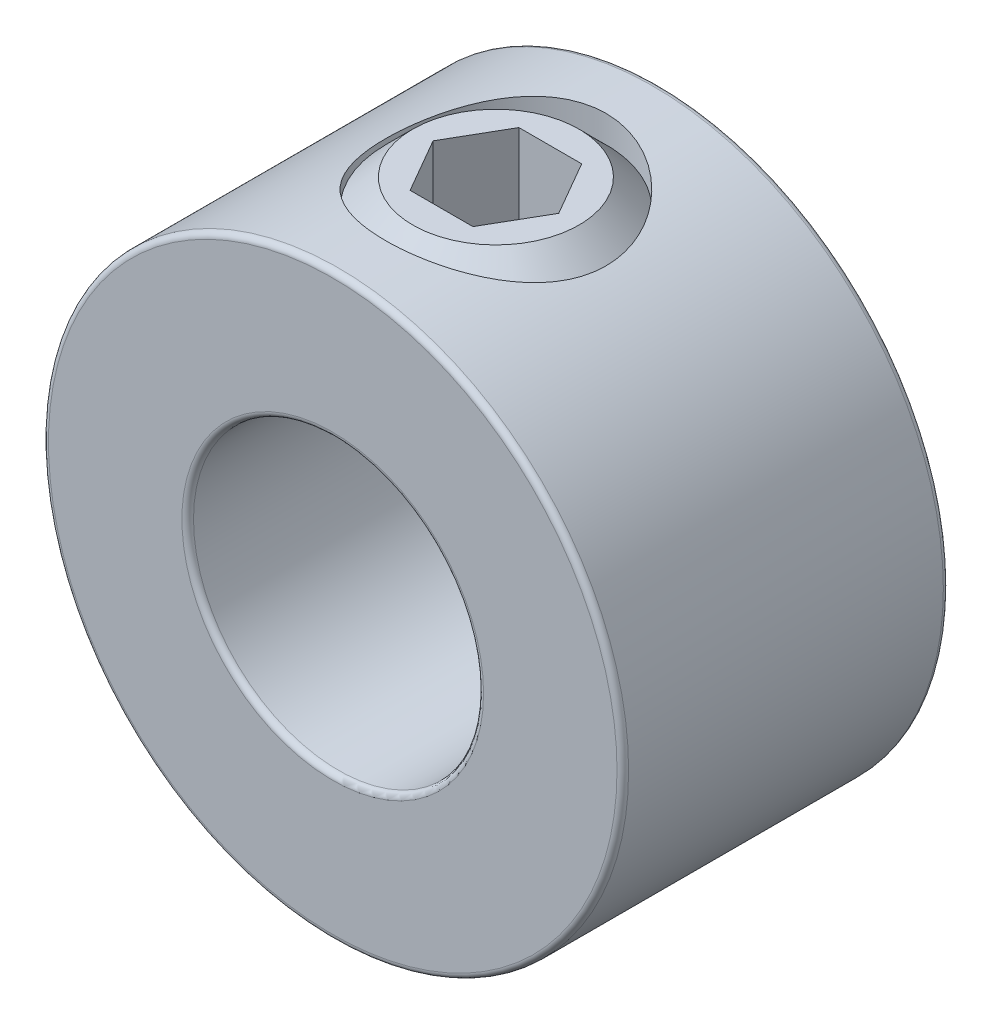
ISO-10303-21;
HEADER;
FILE_DESCRIPTION(('STEP AP214'),'2;1');
FILE_NAME('part.step','',(''),(''),'','','');
FILE_SCHEMA(('AUTOMOTIVE_DESIGN { 1 0 10303 214 1 1 1 1 }'));
ENDSEC;
DATA;
#1=APPLICATION_CONTEXT('core data for automotive mechanical design processes');
#2=APPLICATION_PROTOCOL_DEFINITION('international standard','automotive_design',2000,#1);
#3=PRODUCT_CONTEXT('',#1,'mechanical');
#4=PRODUCT('Part','Part','',(#3));
#5=PRODUCT_RELATED_PRODUCT_CATEGORY('part','',(#4));
#6=PRODUCT_DEFINITION_FORMATION('','',#4);
#7=PRODUCT_DEFINITION_CONTEXT('part definition',#1,'design');
#8=PRODUCT_DEFINITION('design','',#6,#7);
#9=PRODUCT_DEFINITION_SHAPE('','',#8);
#10=(LENGTH_UNIT() NAMED_UNIT(*) SI_UNIT(.MILLI.,.METRE.));
#11=(NAMED_UNIT(*) PLANE_ANGLE_UNIT() SI_UNIT($,.RADIAN.));
#12=(NAMED_UNIT(*) SI_UNIT($,.STERADIAN.) SOLID_ANGLE_UNIT());
#13=UNCERTAINTY_MEASURE_WITH_UNIT(LENGTH_MEASURE(1.E-05),#10,'distance_accuracy_value','');
#14=(GEOMETRIC_REPRESENTATION_CONTEXT(3) GLOBAL_UNCERTAINTY_ASSIGNED_CONTEXT((#13)) GLOBAL_UNIT_ASSIGNED_CONTEXT((#10,
#11,#12)) REPRESENTATION_CONTEXT('',''));
#15=CARTESIAN_POINT('',(0.,0.,0.));
#16=DIRECTION('',(0.,0.,1.));
#17=DIRECTION('',(1.,0.,0.));
#18=AXIS2_PLACEMENT_3D('',#15,#16,#17);
#19=CARTESIAN_POINT('',(0.,6.35,0.));
#20=DIRECTION('',(0.,1.,0.));
#21=DIRECTION('',(-1.,0.,0.));
#22=AXIS2_PLACEMENT_3D('',#19,#20,#21);
#23=PLANE('',#22);
#24=CARTESIAN_POINT('',(0.,6.35,0.));
#25=DIRECTION('',(0.,1.,0.));
#26=DIRECTION('',(-1.,0.,0.));
#27=AXIS2_PLACEMENT_3D('',#24,#25,#26);
#28=CIRCLE('',#27,1.81975161629017);
#29=CARTESIAN_POINT('',(-1.81975161629017,6.35,0.));
#30=VERTEX_POINT('',#29);
#31=EDGE_CURVE('E12',#30,#30,#28,.T.);
#32=ORIENTED_EDGE('',*,*,#31,.T.);
#33=EDGE_LOOP('',(#32));
#34=FACE_BOUND('',#33,.T.);
#35=DIRECTION('',(1.,0.,0.));
#36=VECTOR('',#35,1.);
#37=CARTESIAN_POINT('',(-0.687407664253899,6.34999999999999,-1.190625));
#38=LINE('',#37,#36);
#39=CARTESIAN_POINT('',(-0.687407664253899,6.34999999999999,-1.190625));
#40=VERTEX_POINT('',#39);
#41=CARTESIAN_POINT('',(0.687407664253899,6.35,-1.190625));
#42=VERTEX_POINT('',#41);
#43=EDGE_CURVE('E126',#40,#42,#38,.T.);
#44=ORIENTED_EDGE('',*,*,#43,.T.);
#45=DIRECTION('',(0.5,0.,0.866025403784439));
#46=VECTOR('',#45,1.);
#47=CARTESIAN_POINT('',(0.687407664253899,6.34999999999999,-1.190625));
#48=LINE('',#47,#46);
#49=CARTESIAN_POINT('',(1.3748153285078,6.34999999999999,0.));
#50=VERTEX_POINT('',#49);
#51=EDGE_CURVE('E70',#42,#50,#48,.T.);
#52=ORIENTED_EDGE('',*,*,#51,.T.);
#53=DIRECTION('',(-0.5,0.,0.866025403784439));
#54=VECTOR('',#53,1.);
#55=CARTESIAN_POINT('',(1.3748153285078,6.34999999999999,0.));
#56=LINE('',#55,#54);
#57=CARTESIAN_POINT('',(0.687407664253899,6.34999999999999,1.190625));
#58=VERTEX_POINT('',#57);
#59=EDGE_CURVE('E130',#50,#58,#56,.T.);
#60=ORIENTED_EDGE('',*,*,#59,.T.);
#61=DIRECTION('',(-1.,0.,0.));
#62=VECTOR('',#61,1.);
#63=CARTESIAN_POINT('',(0.687407664253899,6.34999999999999,1.190625));
#64=LINE('',#63,#62);
#65=CARTESIAN_POINT('',(-0.687407664253899,6.34999999999999,1.190625));
#66=VERTEX_POINT('',#65);
#67=EDGE_CURVE('E209',#58,#66,#64,.T.);
#68=ORIENTED_EDGE('',*,*,#67,.T.);
#69=DIRECTION('',(-0.5,0.,-0.866025403784439));
#70=VECTOR('',#69,1.);
#71=CARTESIAN_POINT('',(-0.687407664253899,6.34999999999999,1.190625));
#72=LINE('',#71,#70);
#73=CARTESIAN_POINT('',(-1.3748153285078,6.34999999999999,0.));
#74=VERTEX_POINT('',#73);
#75=EDGE_CURVE('E189',#66,#74,#72,.T.);
#76=ORIENTED_EDGE('',*,*,#75,.T.);
#77=DIRECTION('',(0.5,0.,-0.866025403784439));
#78=VECTOR('',#77,1.);
#79=CARTESIAN_POINT('',(-1.3748153285078,6.34999999999999,0.));
#80=LINE('',#79,#78);
#81=EDGE_CURVE('E182',#74,#40,#80,.T.);
#82=ORIENTED_EDGE('',*,*,#81,.T.);
#83=EDGE_LOOP('',(#44,#52,#60,#68,#76,#82));
#84=FACE_BOUND('',#83,.T.);
#85=ADVANCED_FACE('F55',(#34,#84),#23,.T.);
#86=CARTESIAN_POINT('',(0.,6.35,0.));
#87=DIRECTION('',(0.,-1.,0.));
#88=DIRECTION('',(1.,0.,0.));
#89=AXIS2_PLACEMENT_3D('',#86,#87,#88);
#90=CONICAL_SURFACE('',#89,1.81975161629017,0.785398163397449);
#91=CARTESIAN_POINT('',(0.,5.75675161629017,0.));
#92=DIRECTION('',(0.,1.,0.));
#93=DIRECTION('',(-1.,0.,0.));
#94=AXIS2_PLACEMENT_3D('',#91,#92,#93);
#95=CIRCLE('',#94,2.413);
#96=CARTESIAN_POINT('',(-2.413,5.75675161629017,0.));
#97=VERTEX_POINT('',#96);
#98=EDGE_CURVE('E63',#97,#97,#95,.T.);
#99=ORIENTED_EDGE('',*,*,#98,.T.);
#100=EDGE_LOOP('',(#99));
#101=FACE_BOUND('',#100,.T.);
#102=ORIENTED_EDGE('',*,*,#31,.F.);
#103=EDGE_LOOP('',(#102));
#104=FACE_BOUND('',#103,.T.);
#105=ADVANCED_FACE('F156',(#101,#104),#90,.T.);
#106=CARTESIAN_POINT('',(0.,3.175,0.));
#107=DIRECTION('',(0.,1.,0.));
#108=DIRECTION('',(-1.,0.,0.));
#109=AXIS2_PLACEMENT_3D('',#106,#107,#108);
#110=CYLINDRICAL_SURFACE('',#109,2.413);
#111=CARTESIAN_POINT('',(0.,3.76824838370983,0.));
#112=DIRECTION('',(0.,1.,0.));
#113=DIRECTION('',(-1.,0.,0.));
#114=AXIS2_PLACEMENT_3D('',#111,#112,#113);
#115=CIRCLE('',#114,2.413);
#116=CARTESIAN_POINT('',(-2.413,3.76824838370983,0.));
#117=VERTEX_POINT('',#116);
#118=EDGE_CURVE('E148',#117,#117,#115,.T.);
#119=ORIENTED_EDGE('',*,*,#118,.T.);
#120=EDGE_LOOP('',(#119));
#121=FACE_BOUND('',#120,.T.);
#122=ORIENTED_EDGE('',*,*,#98,.F.);
#123=EDGE_LOOP('',(#122));
#124=FACE_BOUND('',#123,.T.);
#125=ADVANCED_FACE('F159',(#121,#124),#110,.T.);
#126=CARTESIAN_POINT('',(0.,3.76824838370983,0.));
#127=DIRECTION('',(0.,1.,0.));
#128=DIRECTION('',(-1.,0.,0.));
#129=AXIS2_PLACEMENT_3D('',#126,#127,#128);
#130=CONICAL_SURFACE('',#129,2.413,0.785398163397448);
#131=CARTESIAN_POINT('',(0.,3.175,0.));
#132=DIRECTION('',(0.,1.,0.));
#133=DIRECTION('',(-1.,0.,0.));
#134=AXIS2_PLACEMENT_3D('',#131,#132,#133);
#135=CIRCLE('',#134,1.81975161629017);
#136=CARTESIAN_POINT('',(-1.81975161629017,3.175,0.));
#137=VERTEX_POINT('',#136);
#138=EDGE_CURVE('E139',#137,#137,#135,.T.);
#139=ORIENTED_EDGE('',*,*,#138,.T.);
#140=EDGE_LOOP('',(#139));
#141=FACE_BOUND('',#140,.T.);
#142=ORIENTED_EDGE('',*,*,#118,.F.);
#143=EDGE_LOOP('',(#142));
#144=FACE_BOUND('',#143,.T.);
#145=ADVANCED_FACE('F161',(#141,#144),#130,.T.);
#146=CARTESIAN_POINT('',(-1.81975161629017,3.175,0.));
#147=DIRECTION('',(0.,-1.,0.));
#148=DIRECTION('',(1.,0.,0.));
#149=AXIS2_PLACEMENT_3D('',#146,#147,#148);
#150=PLANE('',#149);
#151=CARTESIAN_POINT('',(0.,3.175,0.));
#152=DIRECTION('',(0.,1.,0.));
#153=DIRECTION('',(-1.,0.,0.));
#154=AXIS2_PLACEMENT_3D('',#151,#152,#153);
#155=CIRCLE('',#154,0.711898060451796);
#156=CARTESIAN_POINT('',(-0.711898060451796,3.175,0.));
#157=VERTEX_POINT('',#156);
#158=EDGE_CURVE('E132',#157,#157,#155,.T.);
#159=ORIENTED_EDGE('',*,*,#158,.T.);
#160=EDGE_LOOP('',(#159));
#161=FACE_BOUND('',#160,.T.);
#162=ORIENTED_EDGE('',*,*,#138,.F.);
#163=EDGE_LOOP('',(#162));
#164=FACE_BOUND('',#163,.T.);
#165=ADVANCED_FACE('F168',(#161,#164),#150,.T.);
#166=CARTESIAN_POINT('',(0.,3.175,0.));
#167=DIRECTION('',(0.,-1.,0.));
#168=DIRECTION('',(1.,0.,0.));
#169=AXIS2_PLACEMENT_3D('',#166,#167,#168);
#170=CONICAL_SURFACE('',#169,0.711898060451796,0.785398163397448);
#171=CARTESIAN_POINT('',(0.,3.8868980604518,0.));
#172=VERTEX_POINT('',#171);
#173=VERTEX_LOOP('',#172);
#174=FACE_BOUND('',#173,.T.);
#175=ORIENTED_EDGE('',*,*,#158,.F.);
#176=EDGE_LOOP('',(#175));
#177=FACE_BOUND('',#176,.T.);
#178=ADVANCED_FACE('F261',(#174,#177),#170,.F.);
#179=CARTESIAN_POINT('',(0.687407664253899,3.96874999999999,-1.190625));
#180=DIRECTION('',(-0.866025403784439,0.,0.5));
#181=DIRECTION('',(0.5,0.,0.866025403784438));
#182=AXIS2_PLACEMENT_3D('',#179,#180,#181);
#183=PLANE('',#182);
#184=ORIENTED_EDGE('',*,*,#51,.F.);
#185=DIRECTION('',(0.,1.,0.));
#186=VECTOR('',#185,1.);
#187=CARTESIAN_POINT('',(0.687407664253899,3.96874999999999,-1.190625));
#188=LINE('',#187,#186);
#189=CARTESIAN_POINT('',(0.687407664253899,3.96874999999999,-1.190625));
#190=VERTEX_POINT('',#189);
#191=EDGE_CURVE('E124',#190,#42,#188,.T.);
#192=ORIENTED_EDGE('',*,*,#191,.F.);
#193=DIRECTION('',(0.5,0.,0.866025403784439));
#194=VECTOR('',#193,1.);
#195=CARTESIAN_POINT('',(0.687407664253899,3.96874999999999,-1.190625));
#196=LINE('',#195,#194);
#197=CARTESIAN_POINT('',(1.3748153285078,3.96874999999999,0.));
#198=VERTEX_POINT('',#197);
#199=EDGE_CURVE('E114',#190,#198,#196,.T.);
#200=ORIENTED_EDGE('',*,*,#199,.T.);
#201=DIRECTION('',(0.,1.,0.));
#202=VECTOR('',#201,1.);
#203=CARTESIAN_POINT('',(1.3748153285078,3.96874999999999,0.));
#204=LINE('',#203,#202);
#205=EDGE_CURVE('E123',#198,#50,#204,.T.);
#206=ORIENTED_EDGE('',*,*,#205,.T.);
#207=EDGE_LOOP('',(#184,#192,#200,#206));
#208=FACE_BOUND('',#207,.T.);
#209=ADVANCED_FACE('F122',(#208),#183,.T.);
#210=CARTESIAN_POINT('',(1.3748153285078,3.96874999999999,0.));
#211=DIRECTION('',(-0.866025403784439,0.,-0.5));
#212=DIRECTION('',(-0.5,0.,0.866025403784439));
#213=AXIS2_PLACEMENT_3D('',#210,#211,#212);
#214=PLANE('',#213);
#215=ORIENTED_EDGE('',*,*,#59,.F.);
#216=ORIENTED_EDGE('',*,*,#205,.F.);
#217=DIRECTION('',(-0.5,0.,0.866025403784439));
#218=VECTOR('',#217,1.);
#219=CARTESIAN_POINT('',(1.3748153285078,3.96874999999999,0.));
#220=LINE('',#219,#218);
#221=CARTESIAN_POINT('',(0.687407664253899,3.96874999999999,1.190625));
#222=VERTEX_POINT('',#221);
#223=EDGE_CURVE('E110',#198,#222,#220,.T.);
#224=ORIENTED_EDGE('',*,*,#223,.T.);
#225=DIRECTION('',(0.,1.,0.));
#226=VECTOR('',#225,1.);
#227=CARTESIAN_POINT('',(0.687407664253899,3.96874999999999,1.190625));
#228=LINE('',#227,#226);
#229=EDGE_CURVE('E133',#222,#58,#228,.T.);
#230=ORIENTED_EDGE('',*,*,#229,.T.);
#231=EDGE_LOOP('',(#215,#216,#224,#230));
#232=FACE_BOUND('',#231,.T.);
#233=ADVANCED_FACE('F128',(#232),#214,.T.);
#234=CARTESIAN_POINT('',(0.687407664253899,3.96874999999999,1.190625));
#235=DIRECTION('',(0.,0.,-1.));
#236=DIRECTION('',(-1.,0.,0.));
#237=AXIS2_PLACEMENT_3D('',#234,#235,#236);
#238=PLANE('',#237);
#239=ORIENTED_EDGE('',*,*,#67,.F.);
#240=ORIENTED_EDGE('',*,*,#229,.F.);
#241=DIRECTION('',(-1.,0.,0.));
#242=VECTOR('',#241,1.);
#243=CARTESIAN_POINT('',(0.687407664253899,3.96874999999999,1.190625));
#244=LINE('',#243,#242);
#245=CARTESIAN_POINT('',(-0.687407664253899,3.96874999999999,1.190625));
#246=VERTEX_POINT('',#245);
#247=EDGE_CURVE('E116',#222,#246,#244,.T.);
#248=ORIENTED_EDGE('',*,*,#247,.T.);
#249=DIRECTION('',(0.,1.,0.));
#250=VECTOR('',#249,1.);
#251=CARTESIAN_POINT('',(-0.687407664253899,3.96874999999999,1.190625));
#252=LINE('',#251,#250);
#253=EDGE_CURVE('E141',#246,#66,#252,.T.);
#254=ORIENTED_EDGE('',*,*,#253,.T.);
#255=EDGE_LOOP('',(#239,#240,#248,#254));
#256=FACE_BOUND('',#255,.T.);
#257=ADVANCED_FACE('F207',(#256),#238,.T.);
#258=CARTESIAN_POINT('',(-0.687407664253899,3.96874999999999,1.190625));
#259=DIRECTION('',(0.866025403784439,0.,-0.5));
#260=DIRECTION('',(-0.5,0.,-0.866025403784438));
#261=AXIS2_PLACEMENT_3D('',#258,#259,#260);
#262=PLANE('',#261);
#263=ORIENTED_EDGE('',*,*,#75,.F.);
#264=ORIENTED_EDGE('',*,*,#253,.F.);
#265=DIRECTION('',(-0.5,0.,-0.866025403784439));
#266=VECTOR('',#265,1.);
#267=CARTESIAN_POINT('',(-0.687407664253899,3.96874999999999,1.190625));
#268=LINE('',#267,#266);
#269=CARTESIAN_POINT('',(-1.3748153285078,3.96874999999999,0.));
#270=VERTEX_POINT('',#269);
#271=EDGE_CURVE('E227',#246,#270,#268,.T.);
#272=ORIENTED_EDGE('',*,*,#271,.T.);
#273=DIRECTION('',(0.,1.,0.));
#274=VECTOR('',#273,1.);
#275=CARTESIAN_POINT('',(-1.3748153285078,3.96874999999999,0.));
#276=LINE('',#275,#274);
#277=EDGE_CURVE('E199',#270,#74,#276,.T.);
#278=ORIENTED_EDGE('',*,*,#277,.T.);
#279=EDGE_LOOP('',(#263,#264,#272,#278));
#280=FACE_BOUND('',#279,.T.);
#281=ADVANCED_FACE('F211',(#280),#262,.T.);
#282=CARTESIAN_POINT('',(-1.3748153285078,3.96874999999999,0.));
#283=DIRECTION('',(0.866025403784439,0.,0.5));
#284=DIRECTION('',(0.5,0.,-0.866025403784439));
#285=AXIS2_PLACEMENT_3D('',#282,#283,#284);
#286=PLANE('',#285);
#287=ORIENTED_EDGE('',*,*,#81,.F.);
#288=ORIENTED_EDGE('',*,*,#277,.F.);
#289=DIRECTION('',(0.5,0.,-0.866025403784439));
#290=VECTOR('',#289,1.);
#291=CARTESIAN_POINT('',(-1.3748153285078,3.96874999999999,0.));
#292=LINE('',#291,#290);
#293=CARTESIAN_POINT('',(-0.687407664253899,3.96874999999999,-1.190625));
#294=VERTEX_POINT('',#293);
#295=EDGE_CURVE('E224',#270,#294,#292,.T.);
#296=ORIENTED_EDGE('',*,*,#295,.T.);
#297=DIRECTION('',(0.,1.,0.));
#298=VECTOR('',#297,1.);
#299=CARTESIAN_POINT('',(-0.687407664253899,3.96874999999999,-1.190625));
#300=LINE('',#299,#298);
#301=EDGE_CURVE('E195',#294,#40,#300,.T.);
#302=ORIENTED_EDGE('',*,*,#301,.T.);
#303=EDGE_LOOP('',(#287,#288,#296,#302));
#304=FACE_BOUND('',#303,.T.);
#305=ADVANCED_FACE('F242',(#304),#286,.T.);
#306=CARTESIAN_POINT('',(-0.687407664253899,3.96874999999999,-1.190625));
#307=DIRECTION('',(0.,0.,1.));
#308=DIRECTION('',(1.,0.,0.));
#309=AXIS2_PLACEMENT_3D('',#306,#307,#308);
#310=PLANE('',#309);
#311=ORIENTED_EDGE('',*,*,#43,.F.);
#312=ORIENTED_EDGE('',*,*,#301,.F.);
#313=DIRECTION('',(1.,0.,0.));
#314=VECTOR('',#313,1.);
#315=CARTESIAN_POINT('',(-0.687407664253899,3.96874999999999,-1.190625));
#316=LINE('',#315,#314);
#317=EDGE_CURVE('E196',#294,#190,#316,.T.);
#318=ORIENTED_EDGE('',*,*,#317,.T.);
#319=ORIENTED_EDGE('',*,*,#191,.T.);
#320=EDGE_LOOP('',(#311,#312,#318,#319));
#321=FACE_BOUND('',#320,.T.);
#322=ADVANCED_FACE('F243',(#321),#310,.T.);
#323=CARTESIAN_POINT('',(1.3748153285078,3.96874999999999,0.));
#324=DIRECTION('',(0.,-1.,0.));
#325=DIRECTION('',(0.,0.,-1.));
#326=AXIS2_PLACEMENT_3D('',#323,#324,#325);
#327=PLANE('',#326);
#328=ORIENTED_EDGE('',*,*,#199,.F.);
#329=ORIENTED_EDGE('',*,*,#317,.F.);
#330=ORIENTED_EDGE('',*,*,#295,.F.);
#331=ORIENTED_EDGE('',*,*,#271,.F.);
#332=ORIENTED_EDGE('',*,*,#247,.F.);
#333=ORIENTED_EDGE('',*,*,#223,.F.);
#334=EDGE_LOOP('',(#328,#329,#330,#331,#332,#333));
#335=FACE_BOUND('',#334,.T.);
#336=ADVANCED_FACE('F112',(#335),#327,.F.);
#337=CLOSED_SHELL('',(#85,#105,#125,#145,#165,#178,#209,#233,#257,#281,#305,#322,#336));
#338=MANIFOLD_SOLID_BREP('B2',#337);
#339=CARTESIAN_POINT('',(0.,0.,3.571875));
#340=DIRECTION('',(0.,0.,1.));
#341=DIRECTION('',(1.,0.,0.));
#342=AXIS2_PLACEMENT_3D('',#339,#340,#341);
#343=PLANE('',#342);
#344=CARTESIAN_POINT('',(0.,0.,3.571875));
#345=DIRECTION('',(0.,0.,1.));
#346=DIRECTION('',(1.,0.,0.));
#347=AXIS2_PLACEMENT_3D('',#344,#345,#346);
#348=CIRCLE('',#347,3.302);
#349=CARTESIAN_POINT('',(3.302,0.,3.571875));
#350=VERTEX_POINT('',#349);
#351=EDGE_CURVE('E370',#350,#350,#348,.F.);
#352=ORIENTED_EDGE('',*,*,#351,.T.);
#353=EDGE_LOOP('',(#352));
#354=FACE_BOUND('',#353,.T.);
#355=CARTESIAN_POINT('',(0.,0.,3.571875));
#356=DIRECTION('',(0.,0.,1.));
#357=DIRECTION('',(1.,0.,0.));
#358=AXIS2_PLACEMENT_3D('',#355,#356,#357);
#359=CIRCLE('',#358,6.223);
#360=CARTESIAN_POINT('',(6.223,0.,3.571875));
#361=VERTEX_POINT('',#360);
#362=EDGE_CURVE('E376',#361,#361,#359,.T.);
#363=ORIENTED_EDGE('',*,*,#362,.T.);
#364=EDGE_LOOP('',(#363));
#365=FACE_BOUND('',#364,.T.);
#366=ADVANCED_FACE('F356',(#354,#365),#343,.T.);
#367=CARTESIAN_POINT('',(0.,0.,-3.571875));
#368=DIRECTION('',(0.,0.,1.));
#369=DIRECTION('',(1.,0.,0.));
#370=AXIS2_PLACEMENT_3D('',#367,#368,#369);
#371=PLANE('',#370);
#372=CARTESIAN_POINT('',(0.,0.,-3.571875));
#373=DIRECTION('',(0.,0.,1.));
#374=DIRECTION('',(1.,0.,0.));
#375=AXIS2_PLACEMENT_3D('',#372,#373,#374);
#376=CIRCLE('',#375,3.302);
#377=CARTESIAN_POINT('',(3.302,0.,-3.571875));
#378=VERTEX_POINT('',#377);
#379=EDGE_CURVE('E390',#378,#378,#376,.T.);
#380=ORIENTED_EDGE('',*,*,#379,.T.);
#381=EDGE_LOOP('',(#380));
#382=FACE_BOUND('',#381,.T.);
#383=CARTESIAN_POINT('',(0.,0.,-3.571875));
#384=DIRECTION('',(0.,0.,1.));
#385=DIRECTION('',(1.,0.,0.));
#386=AXIS2_PLACEMENT_3D('',#383,#384,#385);
#387=CIRCLE('',#386,6.223);
#388=CARTESIAN_POINT('',(6.223,0.,-3.571875));
#389=VERTEX_POINT('',#388);
#390=EDGE_CURVE('E394',#389,#389,#387,.F.);
#391=ORIENTED_EDGE('',*,*,#390,.T.);
#392=EDGE_LOOP('',(#391));
#393=FACE_BOUND('',#392,.T.);
#394=ADVANCED_FACE('F432',(#382,#393),#371,.F.);
#395=CARTESIAN_POINT('',(0.,0.,3.571875));
#396=DIRECTION('',(0.,0.,-1.));
#397=DIRECTION('',(-1.,0.,0.));
#398=AXIS2_PLACEMENT_3D('',#395,#396,#397);
#399=CYLINDRICAL_SURFACE('',#398,6.35);
#400=CARTESIAN_POINT('',(0.,0.,-3.444875));
#401=DIRECTION('',(0.,0.,1.));
#402=DIRECTION('',(1.,0.,0.));
#403=AXIS2_PLACEMENT_3D('',#400,#401,#402);
#404=CIRCLE('',#403,6.35);
#405=CARTESIAN_POINT('',(6.35,0.,-3.444875));
#406=VERTEX_POINT('',#405);
#407=EDGE_CURVE('E54',#406,#406,#404,.T.);
#408=ORIENTED_EDGE('',*,*,#407,.T.);
#409=EDGE_LOOP('',(#408));
#410=FACE_BOUND('',#409,.T.);
#411=CARTESIAN_POINT('',(0.,0.,3.444875));
#412=DIRECTION('',(0.,0.,1.));
#413=DIRECTION('',(1.,0.,0.));
#414=AXIS2_PLACEMENT_3D('',#411,#412,#413);
#415=CIRCLE('',#414,6.35);
#416=CARTESIAN_POINT('',(6.35,0.,3.444875));
#417=VERTEX_POINT('',#416);
#418=EDGE_CURVE('E364',#417,#417,#415,.F.);
#419=ORIENTED_EDGE('',*,*,#418,.T.);
#420=EDGE_LOOP('',(#419));
#421=FACE_BOUND('',#420,.T.);
#422=CARTESIAN_POINT('',(0.,6.35,-2.413));
#423=CARTESIAN_POINT('',(0.130555931467962,6.35000398969011,-2.41300527534602));
#424=CARTESIAN_POINT('',(0.261076241377739,6.34593890816647,-2.4023714543113));
#425=CARTESIAN_POINT('',(0.518209446534913,6.33012963929965,-2.36029479676423));
#426=CARTESIAN_POINT('',(0.644823015088655,6.31838678300935,-2.32885556715778));
#427=CARTESIAN_POINT('',(0.890396734122701,6.28848040494,-2.24644511602075));
#428=CARTESIAN_POINT('',(1.00937135935963,6.27032947705095,-2.19551218938446));
#429=CARTESIAN_POINT('',(1.23707694907279,6.22940932060409,-2.07575764561934));
#430=CARTESIAN_POINT('',(1.34580507871092,6.20663881943741,-2.00693109764769));
#431=CARTESIAN_POINT('',(1.5546544090621,6.15771932779737,-1.85022277092613));
#432=CARTESIAN_POINT('',(1.65427192875035,6.13147296383124,-1.76170041624995));
#433=CARTESIAN_POINT('',(1.83765571561736,6.07903240405007,-1.56947315042905));
#434=CARTESIAN_POINT('',(1.92141693988139,6.05283822744466,-1.46576342765122));
#435=CARTESIAN_POINT('',(2.07395660623911,6.00232668170519,-1.24113386470124));
#436=CARTESIAN_POINT('',(2.14201618015845,5.97812365120729,-1.11969756154783));
#437=CARTESIAN_POINT('',(2.25652093858858,5.93585432476053,-0.866038380432351));
#438=CARTESIAN_POINT('',(2.30297502037546,5.91778550353544,-0.733819969020803));
#439=CARTESIAN_POINT('',(2.37094947712185,5.89087364983883,-0.46815363189803));
#440=CARTESIAN_POINT('',(2.39343294050412,5.88167580744491,-0.334989300795486));
#441=CARTESIAN_POINT('',(2.41583880524757,5.87251090464605,-0.0664845962936197));
#442=CARTESIAN_POINT('',(2.41577084821779,5.87253989940926,0.0688548224232351));
#443=CARTESIAN_POINT('',(2.39381090108878,5.88152011871453,0.328972227003014));
#444=CARTESIAN_POINT('',(2.37326609797153,5.88992057372023,0.453886522563246));
#445=CARTESIAN_POINT('',(2.31316652422954,5.91378008823147,0.698339704990829));
#446=CARTESIAN_POINT('',(2.27360881167116,5.92924024008996,0.817877756841903));
#447=CARTESIAN_POINT('',(2.17588364092748,5.96580146890692,1.0508916152852));
#448=CARTESIAN_POINT('',(2.11737290423754,5.98700531598431,1.16420661484106));
#449=CARTESIAN_POINT('',(1.98364217411328,6.03263175509447,1.37979639920587));
#450=CARTESIAN_POINT('',(1.90841630395244,6.05705547794376,1.4820672822727));
#451=CARTESIAN_POINT('',(1.73726689770536,6.10842961274997,1.68010694238863));
#452=CARTESIAN_POINT('',(1.64027173491613,6.13543795015635,1.77493688260015));
#453=CARTESIAN_POINT('',(1.43144868882472,6.18748920351012,1.94726806056401));
#454=CARTESIAN_POINT('',(1.31961840653187,6.2125318005324,2.02476649017818));
#455=CARTESIAN_POINT('',(1.08185265975391,6.25835188225341,2.16130771487283));
#456=CARTESIAN_POINT('',(0.955717417234618,6.27905339803369,2.22002994310971));
#457=CARTESIAN_POINT('',(0.694375189035109,6.31329326294077,2.31510736575226));
#458=CARTESIAN_POINT('',(0.559172376611221,6.32683488218724,2.3514727723643));
#459=CARTESIAN_POINT('',(0.291428150212525,6.3446501972992,2.39898109857718));
#460=CARTESIAN_POINT('',(0.159141645079808,6.34938771868047,2.41138775288999));
#461=CARTESIAN_POINT('',(-0.105693065348276,6.35049981057155,2.41431626348443));
#462=CARTESIAN_POINT('',(-0.238241203822052,6.34687629478166,2.40484312768025));
#463=CARTESIAN_POINT('',(-0.494323602805378,6.33197908606406,2.36523562382545));
#464=CARTESIAN_POINT('',(-0.61800684441211,6.32101461634214,2.33593589818825));
#465=CARTESIAN_POINT('',(-0.858609565436108,6.29285092848222,2.25861304376362));
#466=CARTESIAN_POINT('',(-0.975528163914414,6.27565090041604,2.21058748264173));
#467=CARTESIAN_POINT('',(-1.20317276582384,6.23607457125026,2.09563503714011));
#468=CARTESIAN_POINT('',(-1.3136121499673,6.21355984396609,2.02818967610491));
#469=CARTESIAN_POINT('',(-1.52197988578177,6.16583504517286,1.87689595883598));
#470=CARTESIAN_POINT('',(-1.61990351002366,6.14062396176678,1.79304143465584));
#471=CARTESIAN_POINT('',(-1.80656807112922,6.08841217199752,1.60543272496061));
#472=CARTESIAN_POINT('',(-1.89441393314817,6.06139435477813,1.5007904098217));
#473=CARTESIAN_POINT('',(-2.05148411432654,6.01005496187559,1.27772800811267));
#474=CARTESIAN_POINT('',(-2.12070651399853,5.98573366426972,1.15930650314625));
#475=CARTESIAN_POINT('',(-2.23870023772464,5.94261798623815,0.910922748538602));
#476=CARTESIAN_POINT('',(-2.28736466342468,5.92385264334907,0.780904332023381));
#477=CARTESIAN_POINT('',(-2.36177800946808,5.89458517077402,0.513602694331982));
#478=CARTESIAN_POINT('',(-2.38754162954713,5.8840777409413,0.376324193363579));
#479=CARTESIAN_POINT('',(-2.41408994040532,5.87323215610138,0.108127165215383));
#480=CARTESIAN_POINT('',(-2.41640623148607,5.87227054588007,-0.0226157343841075));
#481=CARTESIAN_POINT('',(-2.3999373204655,5.8790202253426,-0.282524873396556));
#482=CARTESIAN_POINT('',(-2.38115423316032,5.88673064582666,-0.41169126951125));
#483=CARTESIAN_POINT('',(-2.32422421188573,5.90943043237583,-0.660552265849344));
#484=CARTESIAN_POINT('',(-2.28672002796391,5.92417751295514,-0.780417919491674));
#485=CARTESIAN_POINT('',(-2.19398528189399,5.95914188552999,-1.01222145618602));
#486=CARTESIAN_POINT('',(-2.13875018285588,5.97936057736356,-1.12415730124382));
#487=CARTESIAN_POINT('',(-2.00869997639504,6.02433337271119,-1.34342800575803));
#488=CARTESIAN_POINT('',(-1.93299650808671,6.04927206356278,-1.4501976241717));
#489=CARTESIAN_POINT('',(-1.76551836882645,6.10025417003155,-1.65000619367226));
#490=CARTESIAN_POINT('',(-1.67373852090438,6.12629793945648,-1.74304070389426));
#491=CARTESIAN_POINT('',(-1.47055494697206,6.17831294001547,-1.91807209951937));
#492=CARTESIAN_POINT('',(-1.35833856072122,6.20419794006484,-1.99915556641372));
#493=CARTESIAN_POINT('',(-1.12096041375387,6.25144642675378,-2.14129762074769));
#494=CARTESIAN_POINT('',(-0.995797050693124,6.27280935273315,-2.20235372565052));
#495=CARTESIAN_POINT('',(-0.728778395788011,6.30955475572144,-2.30499263616226));
#496=CARTESIAN_POINT('',(-0.58638469778337,6.32454657619379,-2.3453288052365));
#497=CARTESIAN_POINT('',(-0.295976705251577,6.34476431329028,-2.39932232882264));
#498=CARTESIAN_POINT('',(-0.147965475024477,6.34999547828747,-2.41299402119021));
#499=CARTESIAN_POINT('',(0.,6.35,-2.413));
#500=B_SPLINE_CURVE_WITH_KNOTS('',3,(#422,#423,#424,#425,#426,#427,#428,#429,#430,#431,#432,
#433,#434,#435,#436,#437,#438,#439,#440,#441,#442,#443,#444,#445,#446,#447,#448,#449,#450,#451,
#452,#453,#454,#455,#456,#457,#458,#459,#460,#461,#462,#463,#464,#465,#466,#467,#468,#469,#470,
#471,#472,#473,#474,#475,#476,#477,#478,#479,#480,#481,#482,#483,#484,#485,#486,#487,#488,#489,
#490,#491,#492,#493,#494,#495,#496,#497,#498,#499),.UNSPECIFIED.,.T.,.F.,(4,2,2,2,2,2,2,2,2,2,2,
2,2,2,2,2,2,2,2,2,2,2,2,2,2,2,2,2,2,2,2,2,2,2,2,2,2,2,4),(0.,0.391121887064184,
0.782175985486185,1.17246577830223,1.56286323524963,1.96854634212709,2.37435825594016,
2.79613130529395,3.21773051175688,3.62166628723491,4.02542936468621,4.40427313209371,
4.78317553819666,5.16936515238192,5.55569075901495,5.96873424705112,6.38184461005431,
6.80167192308661,7.22130732355892,7.61812936188612,8.01486058335588,8.39585156202364,
8.77689204483065,9.16923685274999,9.56172942118012,9.9776135359701,10.3935404987953,
10.8116043631128,11.2293996833676,11.6197130905881,12.0099873800853,12.3876994067832,
12.7655081575183,13.1635000328781,13.5616203073395,13.9821012344605,14.4026342635628,
14.8461505355472,15.2894282569131),.UNSPECIFIED.);
#501=CARTESIAN_POINT('',(0.,6.35,-2.413));
#502=VERTEX_POINT('',#501);
#503=EDGE_CURVE('E398',#502,#502,#500,.T.);
#504=ORIENTED_EDGE('',*,*,#503,.T.);
#505=EDGE_LOOP('',(#504));
#506=FACE_BOUND('',#505,.T.);
#507=ADVANCED_FACE('F428',(#410,#421,#506),#399,.T.);
#508=CARTESIAN_POINT('',(0.,0.,3.571875));
#509=DIRECTION('',(0.,0.,-1.));
#510=DIRECTION('',(-1.,0.,0.));
#511=AXIS2_PLACEMENT_3D('',#508,#509,#510);
#512=CYLINDRICAL_SURFACE('',#511,3.175);
#513=CARTESIAN_POINT('',(0.,0.,-3.444875));
#514=DIRECTION('',(0.,0.,1.));
#515=DIRECTION('',(1.,0.,0.));
#516=AXIS2_PLACEMENT_3D('',#513,#514,#515);
#517=CIRCLE('',#516,3.175);
#518=CARTESIAN_POINT('',(3.175,0.,-3.444875));
#519=VERTEX_POINT('',#518);
#520=EDGE_CURVE('E382',#519,#519,#517,.F.);
#521=ORIENTED_EDGE('',*,*,#520,.T.);
#522=EDGE_LOOP('',(#521));
#523=FACE_BOUND('',#522,.T.);
#524=CARTESIAN_POINT('',(0.,0.,3.444875));
#525=DIRECTION('',(0.,0.,1.));
#526=DIRECTION('',(1.,0.,0.));
#527=AXIS2_PLACEMENT_3D('',#524,#525,#526);
#528=CIRCLE('',#527,3.175);
#529=CARTESIAN_POINT('',(3.175,0.,3.444875));
#530=VERTEX_POINT('',#529);
#531=EDGE_CURVE('E386',#530,#530,#528,.T.);
#532=ORIENTED_EDGE('',*,*,#531,.T.);
#533=EDGE_LOOP('',(#532));
#534=FACE_BOUND('',#533,.T.);
#535=CARTESIAN_POINT('',(0.,3.175,-2.413));
#536=CARTESIAN_POINT('',(0.117443171605231,3.17499092904906,-2.41299058031907));
#537=CARTESIAN_POINT('',(0.23503818841931,3.16841692674332,-2.4043581847269));
#538=CARTESIAN_POINT('',(0.466484967913331,3.14271336140829,-2.37038175457781));
#539=CARTESIAN_POINT('',(0.580328596183407,3.12355818632314,-2.34500362950094));
#540=CARTESIAN_POINT('',(0.80033693546367,3.07452724978738,-2.27928432631256));
#541=CARTESIAN_POINT('',(0.906543039514099,3.04471549355359,-2.23903243487973));
#542=CARTESIAN_POINT('',(1.10997011785933,2.97659455342082,-2.14548015839209));
#543=CARTESIAN_POINT('',(1.20719255384311,2.93828675533249,-2.09218190121579));
#544=CARTESIAN_POINT('',(1.40022726688529,2.85170030734834,-1.96882085307546));
#545=CARTESIAN_POINT('',(1.49506365463583,2.80282512985173,-1.89765858122501));
#546=CARTESIAN_POINT('',(1.67223382567996,2.7008760546092,-1.7435641158176));
#547=CARTESIAN_POINT('',(1.75454859398162,2.64779595363648,-1.66061438438314));
#548=CARTESIAN_POINT('',(1.92203888294129,2.5296135351956,-1.46565859240837));
#549=CARTESIAN_POINT('',(2.00423140536036,2.4643124367144,-1.35120048467098));
#550=CARTESIAN_POINT('',(2.14857118710811,2.33951215894306,-1.10735736644856));
#551=CARTESIAN_POINT('',(2.21074385995913,2.28000569136514,-0.977991565717825));
#552=CARTESIAN_POINT('',(2.29462037317499,2.19490180220151,-0.752497308608559));
#553=CARTESIAN_POINT('',(2.32287346332998,2.16472241167552,-0.66055827907226));
#554=CARTESIAN_POINT('',(2.36849823013454,2.11470881226284,-0.47139038700259));
#555=CARTESIAN_POINT('',(2.38589523743028,2.09485053921884,-0.374174418255039));
#556=CARTESIAN_POINT('',(2.40870358471578,2.06860028206587,-0.175460476777278));
#557=CARTESIAN_POINT('',(2.4139959431512,2.06234200752845,-0.073929905731699));
#558=CARTESIAN_POINT('',(2.41169213967819,2.06503422028968,0.128798184800726));
#559=CARTESIAN_POINT('',(2.40409306334661,2.07398814667793,0.22999562379254));
#560=CARTESIAN_POINT('',(2.37836508518799,2.10340433920656,0.416917246134645));
#561=CARTESIAN_POINT('',(2.36156171265492,2.1224091464969,0.503073429560243));
#562=CARTESIAN_POINT('',(2.31942910669347,2.16837457604816,0.671064962974234));
#563=CARTESIAN_POINT('',(2.29409116468348,2.19534332114491,0.752895800354834));
#564=CARTESIAN_POINT('',(2.21702947004233,2.27376916611904,0.962631680289748));
#565=CARTESIAN_POINT('',(2.15880606368402,2.32983777456744,1.08642083974007));
#566=CARTESIAN_POINT('',(2.0240584670168,2.44783368287627,1.32063556736185));
#567=CARTESIAN_POINT('',(1.94748865288627,2.50977535205404,1.43102676980356));
#568=CARTESIAN_POINT('',(1.77457755480707,2.63500191833982,1.64086400526623));
#569=CARTESIAN_POINT('',(1.67772908569284,2.69827393808612,1.73990181478264));
#570=CARTESIAN_POINT('',(1.46641465679805,2.81868720555883,1.92133244794249));
#571=CARTESIAN_POINT('',(1.35198192561174,2.87583967861316,2.00375600179513));
#572=CARTESIAN_POINT('',(1.1302184691796,2.96897239724258,2.13504920976438));
#573=CARTESIAN_POINT('',(1.02573469648465,3.00691100546587,2.18732233798596));
#574=CARTESIAN_POINT('',(0.807524498934965,3.07269924184988,2.27691743542351));
#575=CARTESIAN_POINT('',(0.693803632023793,3.10055488265641,2.31424831636675));
#576=CARTESIAN_POINT('',(0.458986561176873,3.14392869528766,2.37204565582169));
#577=CARTESIAN_POINT('',(0.337846653718269,3.15936426972399,2.39239924216467));
#578=CARTESIAN_POINT('',(0.0929212408274502,3.17600778354888,2.41433718167044));
#579=CARTESIAN_POINT('',(-0.0308628412677098,3.17722319336241,2.41593138989231));
#580=CARTESIAN_POINT('',(-0.263113673769308,3.16598164725166,2.40112430213952));
#581=CARTESIAN_POINT('',(-0.371784896474092,3.15499411480433,2.38665711938384));
#582=CARTESIAN_POINT('',(-0.584657379974265,3.12256258934286,2.34361709819449));
#583=CARTESIAN_POINT('',(-0.688857782558675,3.10111659842469,2.31504156459624));
#584=CARTESIAN_POINT('',(-0.893151752270642,3.04866013703249,2.24429284461138));
#585=CARTESIAN_POINT('',(-0.993066473951875,3.01741404656932,2.20178337061745));
#586=CARTESIAN_POINT('',(-1.18427030490273,2.94762615076737,2.10512741976429));
#587=CARTESIAN_POINT('',(-1.27555811070553,2.90908324556455,2.05097918840424));
#588=CARTESIAN_POINT('',(-1.4629408219305,2.82008518778891,1.92283493337221));
#589=CARTESIAN_POINT('',(-1.55736336530955,2.76871323654288,1.84703979297132));
#590=CARTESIAN_POINT('',(-1.7330266340156,2.66229345480278,1.68334400808498));
#591=CARTESIAN_POINT('',(-1.81424018707203,2.60723836781931,1.59541908083344));
#592=CARTESIAN_POINT('',(-1.93310120506622,2.51929011373857,1.44596227809647));
#593=CARTESIAN_POINT('',(-1.97518148865632,2.48634042838264,1.38794003709871));
#594=CARTESIAN_POINT('',(-2.05424288960517,2.42143291492003,1.26799956797446));
#595=CARTESIAN_POINT('',(-2.09122218168265,2.38947544500995,1.2060799567393));
#596=CARTESIAN_POINT('',(-2.19405069763864,2.29677780916441,1.01470921513655));
#597=CARTESIAN_POINT('',(-2.25209423008379,2.2389759481709,0.879267670433414));
#598=CARTESIAN_POINT('',(-2.32600727289693,2.16148731453314,0.648667618119571));
#599=CARTESIAN_POINT('',(-2.34951337659766,2.13568591161393,0.557995127674168));
#600=CARTESIAN_POINT('',(-2.38597736286025,2.09487284834006,0.372275602812797));
#601=CARTESIAN_POINT('',(-2.39896041795918,2.0798354491901,0.277239585981548));
#602=CARTESIAN_POINT('',(-2.41347202601588,2.06298898322372,0.0843820043038626));
#603=CARTESIAN_POINT('',(-2.41491881071071,2.06127434940024,-0.0134545208329241));
#604=CARTESIAN_POINT('',(-2.40600289841214,2.07166816759277,-0.20788213648133));
#605=CARTESIAN_POINT('',(-2.39562846174622,2.08379036100337,-0.304471892411458));
#606=CARTESIAN_POINT('',(-2.36137219311358,2.12256830664758,-0.508834367656112));
#607=CARTESIAN_POINT('',(-2.33557340769404,2.15126142901359,-0.615881798172457));
#608=CARTESIAN_POINT('',(-2.27108364148613,2.21923176610734,-0.822515613730422));
#609=CARTESIAN_POINT('',(-2.2323592210675,2.25853638265596,-0.922081817130457));
#610=CARTESIAN_POINT('',(-2.12610942507655,2.35955877527054,-1.15053309693759));
#611=CARTESIAN_POINT('',(-2.05324191025264,2.42403799567888,-1.27569998264042));
#612=CARTESIAN_POINT('',(-1.88728411653423,2.55539518076956,-1.5104318596925));
#613=CARTESIAN_POINT('',(-1.79417076882036,2.62227580852244,-1.61997881541957));
#614=CARTESIAN_POINT('',(-1.58693666845894,2.75272337581287,-1.82362287315767));
#615=CARTESIAN_POINT('',(-1.47252844795802,2.81622750409905,-1.9174704362987));
#616=CARTESIAN_POINT('',(-1.22472214874906,2.93245405690648,-2.0844185884594));
#617=CARTESIAN_POINT('',(-1.09136873492959,2.9852011492147,-2.15756679766189));
#618=CARTESIAN_POINT('',(-0.848324156263042,3.06143310070406,-2.2616762509508));
#619=CARTESIAN_POINT('',(-0.742491250018576,3.08897584082985,-2.29871569194653));
#620=CARTESIAN_POINT('',(-0.524711420429954,3.13329848559572,-2.35794338327758));
#621=CARTESIAN_POINT('',(-0.412780537897338,3.1501052759874,-2.38016873825137));
#622=CARTESIAN_POINT('',(-0.249887399880881,3.16554486424948,-2.40054788675386));
#623=CARTESIAN_POINT('',(-0.200104041382905,3.16908209053624,-2.40520884201812));
#624=CARTESIAN_POINT('',(-0.10022305414221,3.17381185752955,-2.41143725628489));
#625=CARTESIAN_POINT('',(-0.0501253573366512,3.17500387152911,-2.41300402036888));
#626=CARTESIAN_POINT('',(0.,3.175,-2.413));
#627=B_SPLINE_CURVE_WITH_KNOTS('',3,(#535,#536,#537,#538,#539,#540,#541,#542,#543,#544,#545,
#546,#547,#548,#549,#550,#551,#552,#553,#554,#555,#556,#557,#558,#559,#560,#561,#562,#563,#564,
#565,#566,#567,#568,#569,#570,#571,#572,#573,#574,#575,#576,#577,#578,#579,#580,#581,#582,#583,
#584,#585,#586,#587,#588,#589,#590,#591,#592,#593,#594,#595,#596,#597,#598,#599,#600,#601,#602,
#603,#604,#605,#606,#607,#608,#609,#610,#611,#612,#613,#614,#615,#616,#617,#618,#619,#620,#621,
#622,#623,#624,#625,#626),.UNSPECIFIED.,.T.,.F.,(4,2,2,2,2,2,2,2,2,2,2,2,2,2,2,2,2,2,2,2,2,2,2,
2,2,2,2,2,2,2,2,2,2,2,2,2,2,2,2,2,2,2,2,2,2,4),(0.,0.352113770291782,0.704946585369681,
1.05569488379078,1.40638601280107,1.78976092813112,2.17371233600607,2.63773050853704,
3.10115730525324,3.40258553658297,3.70330778533679,4.00697348207613,4.31070783899934,
4.57916413533347,4.84789519559245,5.28900480236595,5.73122295780719,6.18621377116464,
6.64035513804427,7.00739894320242,7.37422351187941,7.74346787257931,8.11251824563582,
8.44151894934109,8.77058252746343,9.10825790412116,9.44598421987268,9.83917081589853,
10.2331562784928,10.469557715449,10.7060435254032,11.1774135342105,11.4679029980311,
11.757695504225,12.0495402292483,12.3416750384965,12.6811651199407,13.0215403855346,
13.4947220530831,13.9684457327182,14.4491015240246,14.9286423754468,15.2736416515379,
15.6177735325977,15.768023783139,15.9183077742625),.UNSPECIFIED.);
#628=CARTESIAN_POINT('',(0.,3.175,-2.413));
#629=VERTEX_POINT('',#628);
#630=EDGE_CURVE('E399',#629,#629,#627,.T.);
#631=ORIENTED_EDGE('',*,*,#630,.F.);
#632=EDGE_LOOP('',(#631));
#633=FACE_BOUND('',#632,.T.);
#634=ADVANCED_FACE('F412',(#523,#534,#633),#512,.F.);
#635=CARTESIAN_POINT('',(0.,6.35,0.));
#636=DIRECTION('',(0.,-1.,0.));
#637=DIRECTION('',(0.,0.,-1.));
#638=AXIS2_PLACEMENT_3D('',#635,#636,#637);
#639=CYLINDRICAL_SURFACE('',#638,2.413);
#640=ORIENTED_EDGE('',*,*,#630,.T.);
#641=EDGE_LOOP('',(#640));
#642=FACE_BOUND('',#641,.T.);
#643=ORIENTED_EDGE('',*,*,#503,.F.);
#644=EDGE_LOOP('',(#643));
#645=FACE_BOUND('',#644,.T.);
#646=ADVANCED_FACE('F415',(#642,#645),#639,.F.);
#647=CARTESIAN_POINT('',(0.,0.,-3.444875));
#648=DIRECTION('',(0.,0.,1.));
#649=DIRECTION('',(1.,0.,0.));
#650=AXIS2_PLACEMENT_3D('',#647,#648,#649);
#651=TOROIDAL_SURFACE('',#650,3.302,0.127);
#652=ORIENTED_EDGE('',*,*,#520,.F.);
#653=EDGE_LOOP('',(#652));
#654=FACE_BOUND('',#653,.T.);
#655=ORIENTED_EDGE('',*,*,#379,.F.);
#656=EDGE_LOOP('',(#655));
#657=FACE_BOUND('',#656,.T.);
#658=ADVANCED_FACE('F418',(#654,#657),#651,.T.);
#659=CARTESIAN_POINT('',(0.,0.,3.444875));
#660=DIRECTION('',(0.,0.,1.));
#661=DIRECTION('',(1.,0.,0.));
#662=AXIS2_PLACEMENT_3D('',#659,#660,#661);
#663=TOROIDAL_SURFACE('',#662,3.302,0.127);
#664=ORIENTED_EDGE('',*,*,#351,.F.);
#665=EDGE_LOOP('',(#664));
#666=FACE_BOUND('',#665,.T.);
#667=ORIENTED_EDGE('',*,*,#531,.F.);
#668=EDGE_LOOP('',(#667));
#669=FACE_BOUND('',#668,.T.);
#670=ADVANCED_FACE('F425',(#666,#669),#663,.T.);
#671=CARTESIAN_POINT('',(0.,0.,-3.444875));
#672=DIRECTION('',(0.,0.,1.));
#673=DIRECTION('',(1.,0.,0.));
#674=AXIS2_PLACEMENT_3D('',#671,#672,#673);
#675=TOROIDAL_SURFACE('',#674,6.223,0.127);
#676=ORIENTED_EDGE('',*,*,#390,.F.);
#677=EDGE_LOOP('',(#676));
#678=FACE_BOUND('',#677,.T.);
#679=ORIENTED_EDGE('',*,*,#407,.F.);
#680=EDGE_LOOP('',(#679));
#681=FACE_BOUND('',#680,.T.);
#682=ADVANCED_FACE('F444',(#678,#681),#675,.T.);
#683=CARTESIAN_POINT('',(0.,0.,3.444875));
#684=DIRECTION('',(0.,0.,1.));
#685=DIRECTION('',(1.,0.,0.));
#686=AXIS2_PLACEMENT_3D('',#683,#684,#685);
#687=TOROIDAL_SURFACE('',#686,6.223,0.127);
#688=ORIENTED_EDGE('',*,*,#418,.F.);
#689=EDGE_LOOP('',(#688));
#690=FACE_BOUND('',#689,.T.);
#691=ORIENTED_EDGE('',*,*,#362,.F.);
#692=EDGE_LOOP('',(#691));
#693=FACE_BOUND('',#692,.T.);
#694=ADVANCED_FACE('F358',(#690,#693),#687,.T.);
#695=CLOSED_SHELL('',(#366,#394,#507,#634,#646,#658,#670,#682,#694));
#696=MANIFOLD_SOLID_BREP('B6',#695);
#697=ADVANCED_BREP_SHAPE_REPRESENTATION('',(#18,#338,#696),#14);
#698=SHAPE_DEFINITION_REPRESENTATION(#9,#697);
ENDSEC;
END-ISO-10303-21;
